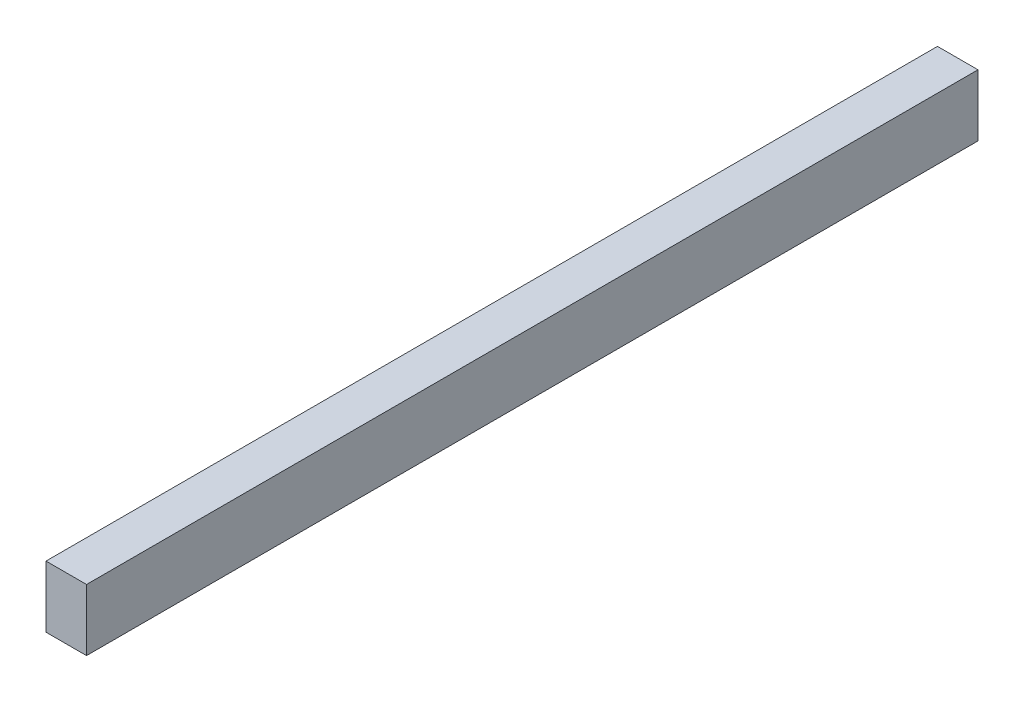
ISO-10303-21;
HEADER;
FILE_DESCRIPTION(('STEP AP214'),'2;1');
FILE_NAME('part.step','',(''),(''),'','','');
FILE_SCHEMA(('AUTOMOTIVE_DESIGN { 1 0 10303 214 1 1 1 1 }'));
ENDSEC;
DATA;
#1=APPLICATION_CONTEXT('core data for automotive mechanical design processes');
#2=APPLICATION_PROTOCOL_DEFINITION('international standard','automotive_design',2000,#1);
#3=PRODUCT_CONTEXT('',#1,'mechanical');
#4=PRODUCT('Part','Part','',(#3));
#5=PRODUCT_RELATED_PRODUCT_CATEGORY('part','',(#4));
#6=PRODUCT_DEFINITION_FORMATION('','',#4);
#7=PRODUCT_DEFINITION_CONTEXT('part definition',#1,'design');
#8=PRODUCT_DEFINITION('design','',#6,#7);
#9=PRODUCT_DEFINITION_SHAPE('','',#8);
#10=(LENGTH_UNIT() NAMED_UNIT(*) SI_UNIT(.MILLI.,.METRE.));
#11=(NAMED_UNIT(*) PLANE_ANGLE_UNIT() SI_UNIT($,.RADIAN.));
#12=(NAMED_UNIT(*) SI_UNIT($,.STERADIAN.) SOLID_ANGLE_UNIT());
#13=UNCERTAINTY_MEASURE_WITH_UNIT(LENGTH_MEASURE(1.E-05),#10,'distance_accuracy_value','');
#14=(GEOMETRIC_REPRESENTATION_CONTEXT(3) GLOBAL_UNCERTAINTY_ASSIGNED_CONTEXT((#13)) GLOBAL_UNIT_ASSIGNED_CONTEXT((#10,
#11,#12)) REPRESENTATION_CONTEXT('',''));
#15=CARTESIAN_POINT('',(0.,0.,0.));
#16=DIRECTION('',(0.,0.,1.));
#17=DIRECTION('',(1.,0.,0.));
#18=AXIS2_PLACEMENT_3D('',#15,#16,#17);
#19=CARTESIAN_POINT('',(-24.314778862922,49.1477137302335,838.2));
#20=DIRECTION('',(1.,0.,0.));
#21=DIRECTION('',(0.,1.,0.));
#22=AXIS2_PLACEMENT_3D('',#19,#20,#21);
#23=PLANE('',#22);
#24=DIRECTION('',(0.,-1.,0.));
#25=VECTOR('',#24,1.);
#26=CARTESIAN_POINT('',(-24.314778862922,49.1477137302335,0.));
#27=LINE('',#26,#25);
#28=CARTESIAN_POINT('',(-24.314778862922,49.1477137302335,0.));
#29=VERTEX_POINT('',#28);
#30=CARTESIAN_POINT('',(-24.314778862922,-8.79603626976648,0.));
#31=VERTEX_POINT('',#30);
#32=EDGE_CURVE('E95',#29,#31,#27,.T.);
#33=ORIENTED_EDGE('',*,*,#32,.T.);
#34=DIRECTION('',(0.,0.,-1.));
#35=VECTOR('',#34,1.);
#36=CARTESIAN_POINT('',(-24.314778862922,-8.79603626976648,838.2));
#37=LINE('',#36,#35);
#38=CARTESIAN_POINT('',(-24.314778862922,-8.79603626976648,838.2));
#39=VERTEX_POINT('',#38);
#40=EDGE_CURVE('E11',#39,#31,#37,.T.);
#41=ORIENTED_EDGE('',*,*,#40,.F.);
#42=DIRECTION('',(0.,-1.,0.));
#43=VECTOR('',#42,1.);
#44=CARTESIAN_POINT('',(-24.314778862922,49.1477137302335,838.2));
#45=LINE('',#44,#43);
#46=CARTESIAN_POINT('',(-24.314778862922,49.1477137302335,838.2));
#47=VERTEX_POINT('',#46);
#48=EDGE_CURVE('E83',#47,#39,#45,.T.);
#49=ORIENTED_EDGE('',*,*,#48,.F.);
#50=DIRECTION('',(0.,0.,-1.));
#51=VECTOR('',#50,1.);
#52=CARTESIAN_POINT('',(-24.314778862922,49.1477137302335,838.2));
#53=LINE('',#52,#51);
#54=EDGE_CURVE('E91',#47,#29,#53,.T.);
#55=ORIENTED_EDGE('',*,*,#54,.T.);
#56=EDGE_LOOP('',(#33,#41,#49,#55));
#57=FACE_BOUND('',#56,.T.);
#58=ADVANCED_FACE('F32',(#57),#23,.F.);
#59=CARTESIAN_POINT('',(-24.314778862922,-8.79603626976648,838.2));
#60=DIRECTION('',(0.,1.,0.));
#61=DIRECTION('',(0.,0.,1.));
#62=AXIS2_PLACEMENT_3D('',#59,#60,#61);
#63=PLANE('',#62);
#64=DIRECTION('',(1.,0.,0.));
#65=VECTOR('',#64,1.);
#66=CARTESIAN_POINT('',(-24.314778862922,-8.79603626976648,0.));
#67=LINE('',#66,#65);
#68=CARTESIAN_POINT('',(13.785221137078,-8.79603626976648,0.));
#69=VERTEX_POINT('',#68);
#70=EDGE_CURVE('E87',#31,#69,#67,.T.);
#71=ORIENTED_EDGE('',*,*,#70,.T.);
#72=DIRECTION('',(0.,0.,-1.));
#73=VECTOR('',#72,1.);
#74=CARTESIAN_POINT('',(13.785221137078,-8.79603626976648,838.2));
#75=LINE('',#74,#73);
#76=CARTESIAN_POINT('',(13.785221137078,-8.79603626976648,838.2));
#77=VERTEX_POINT('',#76);
#78=EDGE_CURVE('E40',#77,#69,#75,.T.);
#79=ORIENTED_EDGE('',*,*,#78,.F.);
#80=DIRECTION('',(1.,0.,0.));
#81=VECTOR('',#80,1.);
#82=CARTESIAN_POINT('',(-24.314778862922,-8.79603626976648,838.2));
#83=LINE('',#82,#81);
#84=EDGE_CURVE('E78',#39,#77,#83,.T.);
#85=ORIENTED_EDGE('',*,*,#84,.F.);
#86=ORIENTED_EDGE('',*,*,#40,.T.);
#87=EDGE_LOOP('',(#71,#79,#85,#86));
#88=FACE_BOUND('',#87,.T.);
#89=ADVANCED_FACE('F86',(#88),#63,.F.);
#90=CARTESIAN_POINT('',(13.785221137078,49.1477137302335,838.2));
#91=DIRECTION('',(-1.,0.,0.));
#92=DIRECTION('',(0.,-1.,0.));
#93=AXIS2_PLACEMENT_3D('',#90,#91,#92);
#94=PLANE('',#93);
#95=DIRECTION('',(0.,1.,0.));
#96=VECTOR('',#95,1.);
#97=CARTESIAN_POINT('',(13.785221137078,49.1477137302335,0.));
#98=LINE('',#97,#96);
#99=CARTESIAN_POINT('',(13.785221137078,49.1477137302335,0.));
#100=VERTEX_POINT('',#99);
#101=EDGE_CURVE('E65',#69,#100,#98,.T.);
#102=ORIENTED_EDGE('',*,*,#101,.T.);
#103=DIRECTION('',(0.,0.,-1.));
#104=VECTOR('',#103,1.);
#105=CARTESIAN_POINT('',(13.785221137078,49.1477137302335,838.2));
#106=LINE('',#105,#104);
#107=CARTESIAN_POINT('',(13.785221137078,49.1477137302335,838.2));
#108=VERTEX_POINT('',#107);
#109=EDGE_CURVE('E88',#108,#100,#106,.T.);
#110=ORIENTED_EDGE('',*,*,#109,.F.);
#111=DIRECTION('',(0.,1.,0.));
#112=VECTOR('',#111,1.);
#113=CARTESIAN_POINT('',(13.785221137078,49.1477137302335,838.2));
#114=LINE('',#113,#112);
#115=EDGE_CURVE('E81',#77,#108,#114,.T.);
#116=ORIENTED_EDGE('',*,*,#115,.F.);
#117=ORIENTED_EDGE('',*,*,#78,.T.);
#118=EDGE_LOOP('',(#102,#110,#116,#117));
#119=FACE_BOUND('',#118,.T.);
#120=ADVANCED_FACE('F89',(#119),#94,.F.);
#121=CARTESIAN_POINT('',(-24.314778862922,49.1477137302335,838.2));
#122=DIRECTION('',(0.,-1.,0.));
#123=DIRECTION('',(0.,0.,-1.));
#124=AXIS2_PLACEMENT_3D('',#121,#122,#123);
#125=PLANE('',#124);
#126=DIRECTION('',(-1.,0.,0.));
#127=VECTOR('',#126,1.);
#128=CARTESIAN_POINT('',(-24.314778862922,49.1477137302335,0.));
#129=LINE('',#128,#127);
#130=EDGE_CURVE('E71',#100,#29,#129,.T.);
#131=ORIENTED_EDGE('',*,*,#130,.T.);
#132=ORIENTED_EDGE('',*,*,#54,.F.);
#133=DIRECTION('',(-1.,0.,0.));
#134=VECTOR('',#133,1.);
#135=CARTESIAN_POINT('',(-24.314778862922,49.1477137302335,838.2));
#136=LINE('',#135,#134);
#137=EDGE_CURVE('E48',#108,#47,#136,.T.);
#138=ORIENTED_EDGE('',*,*,#137,.F.);
#139=ORIENTED_EDGE('',*,*,#109,.T.);
#140=EDGE_LOOP('',(#131,#132,#138,#139));
#141=FACE_BOUND('',#140,.T.);
#142=ADVANCED_FACE('F102',(#141),#125,.F.);
#143=CARTESIAN_POINT('',(0.,0.,838.2));
#144=DIRECTION('',(0.,0.,1.));
#145=DIRECTION('',(1.,0.,0.));
#146=AXIS2_PLACEMENT_3D('',#143,#144,#145);
#147=PLANE('',#146);
#148=ORIENTED_EDGE('',*,*,#48,.T.);
#149=ORIENTED_EDGE('',*,*,#84,.T.);
#150=ORIENTED_EDGE('',*,*,#115,.T.);
#151=ORIENTED_EDGE('',*,*,#137,.T.);
#152=EDGE_LOOP('',(#148,#149,#150,#151));
#153=FACE_BOUND('',#152,.T.);
#154=ADVANCED_FACE('F79',(#153),#147,.T.);
#155=CARTESIAN_POINT('',(0.,0.,0.));
#156=DIRECTION('',(0.,0.,1.));
#157=DIRECTION('',(1.,0.,0.));
#158=AXIS2_PLACEMENT_3D('',#155,#156,#157);
#159=PLANE('',#158);
#160=ORIENTED_EDGE('',*,*,#32,.F.);
#161=ORIENTED_EDGE('',*,*,#130,.F.);
#162=ORIENTED_EDGE('',*,*,#101,.F.);
#163=ORIENTED_EDGE('',*,*,#70,.F.);
#164=EDGE_LOOP('',(#160,#161,#162,#163));
#165=FACE_BOUND('',#164,.T.);
#166=ADVANCED_FACE('F105',(#165),#159,.F.);
#167=CLOSED_SHELL('',(#58,#89,#120,#142,#154,#166));
#168=MANIFOLD_SOLID_BREP('B2',#167);
#169=ADVANCED_BREP_SHAPE_REPRESENTATION('',(#18,#168),#14);
#170=SHAPE_DEFINITION_REPRESENTATION(#9,#169);
ENDSEC;
END-ISO-10303-21;
